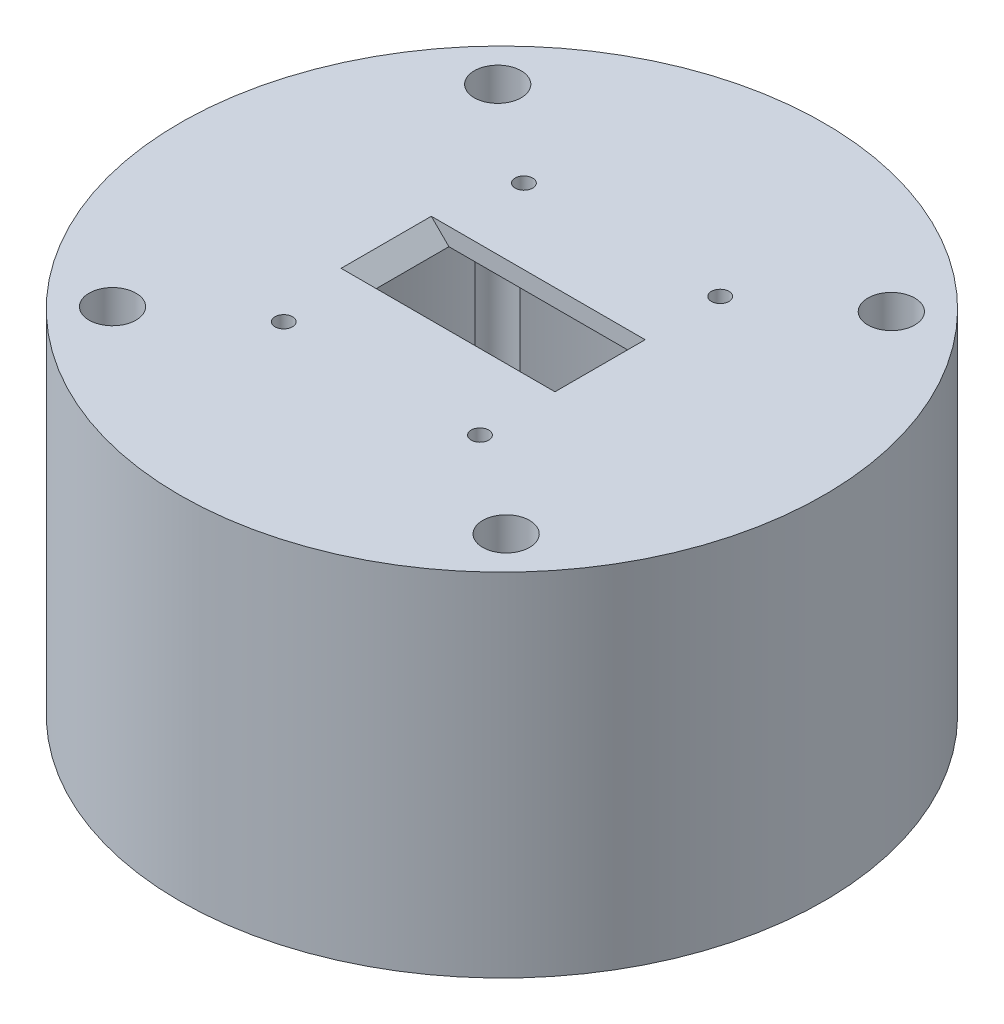
ISO-10303-21;
HEADER;
FILE_DESCRIPTION(('STEP AP214'),'2;1');
FILE_NAME('part.step','',(''),(''),'','','');
FILE_SCHEMA(('AUTOMOTIVE_DESIGN { 1 0 10303 214 1 1 1 1 }'));
ENDSEC;
DATA;
#1=APPLICATION_CONTEXT('core data for automotive mechanical design processes');
#2=APPLICATION_PROTOCOL_DEFINITION('international standard','automotive_design',2000,#1);
#3=PRODUCT_CONTEXT('',#1,'mechanical');
#4=PRODUCT('Part','Part','',(#3));
#5=PRODUCT_RELATED_PRODUCT_CATEGORY('part','',(#4));
#6=PRODUCT_DEFINITION_FORMATION('','',#4);
#7=PRODUCT_DEFINITION_CONTEXT('part definition',#1,'design');
#8=PRODUCT_DEFINITION('design','',#6,#7);
#9=PRODUCT_DEFINITION_SHAPE('','',#8);
#10=(LENGTH_UNIT() NAMED_UNIT(*) SI_UNIT(.MILLI.,.METRE.));
#11=(NAMED_UNIT(*) PLANE_ANGLE_UNIT() SI_UNIT($,.RADIAN.));
#12=(NAMED_UNIT(*) SI_UNIT($,.STERADIAN.) SOLID_ANGLE_UNIT());
#13=UNCERTAINTY_MEASURE_WITH_UNIT(LENGTH_MEASURE(1.E-05),#10,'distance_accuracy_value','');
#14=(GEOMETRIC_REPRESENTATION_CONTEXT(3) GLOBAL_UNCERTAINTY_ASSIGNED_CONTEXT((#13)) GLOBAL_UNIT_ASSIGNED_CONTEXT((#10,
#11,#12)) REPRESENTATION_CONTEXT('',''));
#15=CARTESIAN_POINT('',(0.,0.,0.));
#16=DIRECTION('',(0.,0.,1.));
#17=DIRECTION('',(1.,0.,0.));
#18=AXIS2_PLACEMENT_3D('',#15,#16,#17);
#19=CARTESIAN_POINT('',(16.75,60.,-7.7));
#20=DIRECTION('',(1.,0.,0.));
#21=DIRECTION('',(0.,0.,-1.));
#22=AXIS2_PLACEMENT_3D('',#19,#20,#21);
#23=PLANE('',#22);
#24=DIRECTION('',(0.,0.,-1.));
#25=VECTOR('',#24,1.);
#26=CARTESIAN_POINT('',(16.75,57.,-7.7));
#27=LINE('',#26,#25);
#28=CARTESIAN_POINT('',(16.75,57.,7.7));
#29=VERTEX_POINT('',#28);
#30=CARTESIAN_POINT('',(16.75,57.,-7.7));
#31=VERTEX_POINT('',#30);
#32=EDGE_CURVE('E263',#29,#31,#27,.T.);
#33=ORIENTED_EDGE('',*,*,#32,.F.);
#34=DIRECTION('',(0.,-1.,0.));
#35=VECTOR('',#34,1.);
#36=CARTESIAN_POINT('',(16.75,60.,7.7));
#37=LINE('',#36,#35);
#38=CARTESIAN_POINT('',(16.75,60.,7.7));
#39=VERTEX_POINT('',#38);
#40=EDGE_CURVE('E329',#39,#29,#37,.T.);
#41=ORIENTED_EDGE('',*,*,#40,.F.);
#42=DIRECTION('',(0.,0.,1.));
#43=VECTOR('',#42,1.);
#44=CARTESIAN_POINT('',(16.75,60.,-7.7));
#45=LINE('',#44,#43);
#46=CARTESIAN_POINT('',(16.75,60.,-7.7));
#47=VERTEX_POINT('',#46);
#48=EDGE_CURVE('E325',#47,#39,#45,.T.);
#49=ORIENTED_EDGE('',*,*,#48,.F.);
#50=DIRECTION('',(0.,-1.,0.));
#51=VECTOR('',#50,1.);
#52=CARTESIAN_POINT('',(16.75,60.,-7.7));
#53=LINE('',#52,#51);
#54=EDGE_CURVE('E330',#47,#31,#53,.T.);
#55=ORIENTED_EDGE('',*,*,#54,.T.);
#56=EDGE_LOOP('',(#33,#41,#49,#55));
#57=FACE_BOUND('',#56,.T.);
#58=ADVANCED_FACE('F33',(#57),#23,.F.);
#59=CARTESIAN_POINT('',(-16.75,60.,-7.7));
#60=DIRECTION('',(0.,0.,-1.));
#61=DIRECTION('',(-1.,0.,0.));
#62=AXIS2_PLACEMENT_3D('',#59,#60,#61);
#63=PLANE('',#62);
#64=DIRECTION('',(-1.,0.,0.));
#65=VECTOR('',#64,1.);
#66=CARTESIAN_POINT('',(-16.75,57.,-7.7));
#67=LINE('',#66,#65);
#68=CARTESIAN_POINT('',(-16.75,57.,-7.7));
#69=VERTEX_POINT('',#68);
#70=EDGE_CURVE('E260',#31,#69,#67,.T.);
#71=ORIENTED_EDGE('',*,*,#70,.F.);
#72=ORIENTED_EDGE('',*,*,#54,.F.);
#73=DIRECTION('',(1.,0.,0.));
#74=VECTOR('',#73,1.);
#75=CARTESIAN_POINT('',(-16.75,60.,-7.7));
#76=LINE('',#75,#74);
#77=CARTESIAN_POINT('',(-19.75,60.,-7.7));
#78=VERTEX_POINT('',#77);
#79=EDGE_CURVE('E48',#78,#47,#76,.T.);
#80=ORIENTED_EDGE('',*,*,#79,.F.);
#81=DIRECTION('',(0.707106781186546,-0.707106781186549,0.));
#82=VECTOR('',#81,1.);
#83=CARTESIAN_POINT('',(-18.25,58.5,-7.7));
#84=LINE('',#83,#82);
#85=EDGE_CURVE('E41',#78,#69,#84,.T.);
#86=ORIENTED_EDGE('',*,*,#85,.T.);
#87=EDGE_LOOP('',(#71,#72,#80,#86));
#88=FACE_BOUND('',#87,.T.);
#89=ADVANCED_FACE('F363',(#88),#63,.F.);
#90=CARTESIAN_POINT('',(-16.75,60.,7.7));
#91=DIRECTION('',(0.,0.,1.));
#92=DIRECTION('',(1.,0.,0.));
#93=AXIS2_PLACEMENT_3D('',#90,#91,#92);
#94=PLANE('',#93);
#95=DIRECTION('',(1.,0.,0.));
#96=VECTOR('',#95,1.);
#97=CARTESIAN_POINT('',(-16.75,57.,7.7));
#98=LINE('',#97,#96);
#99=CARTESIAN_POINT('',(-16.75,57.,7.7));
#100=VERTEX_POINT('',#99);
#101=EDGE_CURVE('E256',#100,#29,#98,.T.);
#102=ORIENTED_EDGE('',*,*,#101,.F.);
#103=DIRECTION('',(-0.707106781186546,0.707106781186549,0.));
#104=VECTOR('',#103,1.);
#105=CARTESIAN_POINT('',(-18.25,58.5,7.7));
#106=LINE('',#105,#104);
#107=CARTESIAN_POINT('',(-19.75,60.,7.7));
#108=VERTEX_POINT('',#107);
#109=EDGE_CURVE('E11',#100,#108,#106,.T.);
#110=ORIENTED_EDGE('',*,*,#109,.T.);
#111=DIRECTION('',(-1.,0.,0.));
#112=VECTOR('',#111,1.);
#113=CARTESIAN_POINT('',(-16.75,60.,7.7));
#114=LINE('',#113,#112);
#115=EDGE_CURVE('E56',#39,#108,#114,.T.);
#116=ORIENTED_EDGE('',*,*,#115,.F.);
#117=ORIENTED_EDGE('',*,*,#40,.T.);
#118=EDGE_LOOP('',(#102,#110,#116,#117));
#119=FACE_BOUND('',#118,.T.);
#120=ADVANCED_FACE('F371',(#119),#94,.F.);
#121=CARTESIAN_POINT('',(-16.75,0.,-20.5));
#122=DIRECTION('',(0.,1.,0.));
#123=DIRECTION('',(0.,0.,1.));
#124=AXIS2_PLACEMENT_3D('',#121,#122,#123);
#125=CYLINDRICAL_SURFACE('',#124,1.5);
#126=CARTESIAN_POINT('',(-16.75,60.,-20.5));
#127=DIRECTION('',(0.,1.,0.));
#128=DIRECTION('',(0.,0.,1.));
#129=AXIS2_PLACEMENT_3D('',#126,#127,#128);
#130=CIRCLE('',#129,1.5);
#131=CARTESIAN_POINT('',(-16.75,60.,-19.));
#132=VERTEX_POINT('',#131);
#133=EDGE_CURVE('E322',#132,#132,#130,.T.);
#134=ORIENTED_EDGE('',*,*,#133,.T.);
#135=EDGE_LOOP('',(#134));
#136=FACE_BOUND('',#135,.T.);
#137=CARTESIAN_POINT('',(-16.75,57.,-20.5));
#138=DIRECTION('',(0.,-1.,0.));
#139=DIRECTION('',(0.,0.,-1.));
#140=AXIS2_PLACEMENT_3D('',#137,#138,#139);
#141=CIRCLE('',#140,1.5);
#142=CARTESIAN_POINT('',(-16.75,57.,-22.));
#143=VERTEX_POINT('',#142);
#144=EDGE_CURVE('E253',#143,#143,#141,.F.);
#145=ORIENTED_EDGE('',*,*,#144,.F.);
#146=EDGE_LOOP('',(#145));
#147=FACE_BOUND('',#146,.T.);
#148=ADVANCED_FACE('F460',(#136,#147),#125,.F.);
#149=CARTESIAN_POINT('',(16.75,0.,-20.5));
#150=DIRECTION('',(0.,1.,0.));
#151=DIRECTION('',(0.,0.,1.));
#152=AXIS2_PLACEMENT_3D('',#149,#150,#151);
#153=CYLINDRICAL_SURFACE('',#152,1.5);
#154=CARTESIAN_POINT('',(16.75,60.,-20.5));
#155=DIRECTION('',(0.,1.,0.));
#156=DIRECTION('',(0.,0.,1.));
#157=AXIS2_PLACEMENT_3D('',#154,#155,#156);
#158=CIRCLE('',#157,1.5);
#159=CARTESIAN_POINT('',(16.75,60.,-19.));
#160=VERTEX_POINT('',#159);
#161=EDGE_CURVE('E290',#160,#160,#158,.T.);
#162=ORIENTED_EDGE('',*,*,#161,.T.);
#163=EDGE_LOOP('',(#162));
#164=FACE_BOUND('',#163,.T.);
#165=CARTESIAN_POINT('',(16.75,57.,-20.5));
#166=DIRECTION('',(0.,-1.,0.));
#167=DIRECTION('',(0.,0.,-1.));
#168=AXIS2_PLACEMENT_3D('',#165,#166,#167);
#169=CIRCLE('',#168,1.5);
#170=CARTESIAN_POINT('',(16.75,57.,-22.));
#171=VERTEX_POINT('',#170);
#172=EDGE_CURVE('E250',#171,#171,#169,.F.);
#173=ORIENTED_EDGE('',*,*,#172,.F.);
#174=EDGE_LOOP('',(#173));
#175=FACE_BOUND('',#174,.T.);
#176=ADVANCED_FACE('F456',(#164,#175),#153,.F.);
#177=CARTESIAN_POINT('',(-16.75,0.,20.5));
#178=DIRECTION('',(0.,1.,0.));
#179=DIRECTION('',(0.,0.,1.));
#180=AXIS2_PLACEMENT_3D('',#177,#178,#179);
#181=CYLINDRICAL_SURFACE('',#180,1.5);
#182=CARTESIAN_POINT('',(-16.75,60.,20.5));
#183=DIRECTION('',(0.,1.,0.));
#184=DIRECTION('',(0.,0.,1.));
#185=AXIS2_PLACEMENT_3D('',#182,#183,#184);
#186=CIRCLE('',#185,1.5);
#187=CARTESIAN_POINT('',(-16.75,60.,22.));
#188=VERTEX_POINT('',#187);
#189=EDGE_CURVE('E294',#188,#188,#186,.T.);
#190=ORIENTED_EDGE('',*,*,#189,.T.);
#191=EDGE_LOOP('',(#190));
#192=FACE_BOUND('',#191,.T.);
#193=CARTESIAN_POINT('',(-16.75,57.,20.5));
#194=DIRECTION('',(0.,-1.,0.));
#195=DIRECTION('',(0.,0.,-1.));
#196=AXIS2_PLACEMENT_3D('',#193,#194,#195);
#197=CIRCLE('',#196,1.5);
#198=CARTESIAN_POINT('',(-16.75,57.,19.));
#199=VERTEX_POINT('',#198);
#200=EDGE_CURVE('E247',#199,#199,#197,.F.);
#201=ORIENTED_EDGE('',*,*,#200,.F.);
#202=EDGE_LOOP('',(#201));
#203=FACE_BOUND('',#202,.T.);
#204=ADVANCED_FACE('F459',(#192,#203),#181,.F.);
#205=CARTESIAN_POINT('',(16.75,0.,20.5));
#206=DIRECTION('',(0.,1.,0.));
#207=DIRECTION('',(0.,0.,1.));
#208=AXIS2_PLACEMENT_3D('',#205,#206,#207);
#209=CYLINDRICAL_SURFACE('',#208,1.5);
#210=CARTESIAN_POINT('',(16.75,60.,20.5));
#211=DIRECTION('',(0.,1.,0.));
#212=DIRECTION('',(0.,0.,1.));
#213=AXIS2_PLACEMENT_3D('',#210,#211,#212);
#214=CIRCLE('',#213,1.5);
#215=CARTESIAN_POINT('',(16.75,60.,22.));
#216=VERTEX_POINT('',#215);
#217=EDGE_CURVE('E269',#216,#216,#214,.T.);
#218=ORIENTED_EDGE('',*,*,#217,.T.);
#219=EDGE_LOOP('',(#218));
#220=FACE_BOUND('',#219,.T.);
#221=CARTESIAN_POINT('',(16.75,57.,20.5));
#222=DIRECTION('',(0.,-1.,0.));
#223=DIRECTION('',(0.,0.,-1.));
#224=AXIS2_PLACEMENT_3D('',#221,#222,#223);
#225=CIRCLE('',#224,1.5);
#226=CARTESIAN_POINT('',(16.75,57.,19.));
#227=VERTEX_POINT('',#226);
#228=EDGE_CURVE('E235',#227,#227,#225,.F.);
#229=ORIENTED_EDGE('',*,*,#228,.F.);
#230=EDGE_LOOP('',(#229));
#231=FACE_BOUND('',#230,.T.);
#232=ADVANCED_FACE('F464',(#220,#231),#209,.F.);
#233=CARTESIAN_POINT('',(0.,50.,0.));
#234=DIRECTION('',(0.,-1.,0.));
#235=DIRECTION('',(0.,0.,-1.));
#236=AXIS2_PLACEMENT_3D('',#233,#234,#235);
#237=CYLINDRICAL_SURFACE('',#236,50.);
#238=CARTESIAN_POINT('',(0.,50.,0.));
#239=DIRECTION('',(0.,-1.,0.));
#240=DIRECTION('',(0.,0.,-1.));
#241=AXIS2_PLACEMENT_3D('',#238,#239,#240);
#242=CIRCLE('',#241,50.);
#243=CARTESIAN_POINT('',(37.590562846943,50.,-32.9689184664895));
#244=VERTEX_POINT('',#243);
#245=CARTESIAN_POINT('',(37.590562846943,50.,32.9689184664894));
#246=VERTEX_POINT('',#245);
#247=EDGE_CURVE('E341',#244,#246,#242,.T.);
#248=ORIENTED_EDGE('',*,*,#247,.F.);
#249=DIRECTION('',(0.,1.,0.));
#250=VECTOR('',#249,1.);
#251=CARTESIAN_POINT('',(37.5905628469429,30.,-32.9689184664895));
#252=LINE('',#251,#250);
#253=CARTESIAN_POINT('',(37.5905628469429,0.,-32.9689184664896));
#254=VERTEX_POINT('',#253);
#255=EDGE_CURVE('E319',#244,#254,#252,.F.);
#256=ORIENTED_EDGE('',*,*,#255,.T.);
#257=CARTESIAN_POINT('',(0.,0.,0.));
#258=DIRECTION('',(0.,-1.,0.));
#259=DIRECTION('',(0.,0.,-1.));
#260=AXIS2_PLACEMENT_3D('',#257,#258,#259);
#261=CIRCLE('',#260,50.);
#262=CARTESIAN_POINT('',(37.5905628469429,0.,32.9689184664895));
#263=VERTEX_POINT('',#262);
#264=EDGE_CURVE('E340',#254,#263,#261,.T.);
#265=ORIENTED_EDGE('',*,*,#264,.T.);
#266=DIRECTION('',(0.,1.,0.));
#267=VECTOR('',#266,1.);
#268=CARTESIAN_POINT('',(37.5905628469429,30.,32.9689184664894));
#269=LINE('',#268,#267);
#270=EDGE_CURVE('E293',#263,#246,#269,.T.);
#271=ORIENTED_EDGE('',*,*,#270,.T.);
#272=EDGE_LOOP('',(#248,#256,#265,#271));
#273=FACE_BOUND('',#272,.T.);
#274=ADVANCED_FACE('F398',(#273),#237,.F.);
#275=CARTESIAN_POINT('',(-33.7747495446768,0.,-36.868228777558));
#276=VERTEX_POINT('',#275);
#277=CARTESIAN_POINT('',(33.7747495446768,0.,-36.868228777558));
#278=VERTEX_POINT('',#277);
#279=EDGE_CURVE('E333',#276,#278,#261,.T.);
#280=ORIENTED_EDGE('',*,*,#279,.T.);
#281=DIRECTION('',(0.,1.,0.));
#282=VECTOR('',#281,1.);
#283=CARTESIAN_POINT('',(33.7747495446767,30.,-36.868228777558));
#284=LINE('',#283,#282);
#285=CARTESIAN_POINT('',(33.7747495446767,50.,-36.8682287775581));
#286=VERTEX_POINT('',#285);
#287=EDGE_CURVE('E316',#278,#286,#284,.T.);
#288=ORIENTED_EDGE('',*,*,#287,.T.);
#289=CARTESIAN_POINT('',(-33.7747495446767,50.,-36.8682287775581));
#290=VERTEX_POINT('',#289);
#291=EDGE_CURVE('E336',#290,#286,#242,.T.);
#292=ORIENTED_EDGE('',*,*,#291,.F.);
#293=DIRECTION('',(0.,1.,0.));
#294=VECTOR('',#293,1.);
#295=CARTESIAN_POINT('',(-33.7747495446767,30.,-36.868228777558));
#296=LINE('',#295,#294);
#297=EDGE_CURVE('E313',#290,#276,#296,.F.);
#298=ORIENTED_EDGE('',*,*,#297,.T.);
#299=EDGE_LOOP('',(#280,#288,#292,#298));
#300=FACE_BOUND('',#299,.T.);
#301=ADVANCED_FACE('F441',(#300),#237,.F.);
#302=CARTESIAN_POINT('',(-37.5905628469429,0.,32.9689184664895));
#303=VERTEX_POINT('',#302);
#304=CARTESIAN_POINT('',(-37.5905628469429,0.,-32.9689184664895));
#305=VERTEX_POINT('',#304);
#306=EDGE_CURVE('E344',#303,#305,#261,.T.);
#307=ORIENTED_EDGE('',*,*,#306,.T.);
#308=DIRECTION('',(0.,1.,0.));
#309=VECTOR('',#308,1.);
#310=CARTESIAN_POINT('',(-37.5905628469429,30.,-32.9689184664894));
#311=LINE('',#310,#309);
#312=CARTESIAN_POINT('',(-37.590562846943,50.,-32.9689184664894));
#313=VERTEX_POINT('',#312);
#314=EDGE_CURVE('E310',#305,#313,#311,.T.);
#315=ORIENTED_EDGE('',*,*,#314,.T.);
#316=CARTESIAN_POINT('',(-37.590562846943,50.,32.9689184664894));
#317=VERTEX_POINT('',#316);
#318=EDGE_CURVE('E339',#317,#313,#242,.T.);
#319=ORIENTED_EDGE('',*,*,#318,.F.);
#320=DIRECTION('',(0.,1.,0.));
#321=VECTOR('',#320,1.);
#322=CARTESIAN_POINT('',(-37.5905628469429,30.,32.9689184664894));
#323=LINE('',#322,#321);
#324=EDGE_CURVE('E307',#317,#303,#323,.F.);
#325=ORIENTED_EDGE('',*,*,#324,.T.);
#326=EDGE_LOOP('',(#307,#315,#319,#325));
#327=FACE_BOUND('',#326,.T.);
#328=ADVANCED_FACE('F385',(#327),#237,.F.);
#329=CARTESIAN_POINT('',(0.,60.,0.));
#330=DIRECTION('',(0.,-1.,0.));
#331=DIRECTION('',(0.,0.,-1.));
#332=AXIS2_PLACEMENT_3D('',#329,#330,#331);
#333=CYLINDRICAL_SURFACE('',#332,55.);
#334=CARTESIAN_POINT('',(0.,60.,0.));
#335=DIRECTION('',(0.,1.,0.));
#336=DIRECTION('',(0.,0.,1.));
#337=AXIS2_PLACEMENT_3D('',#334,#335,#336);
#338=CIRCLE('',#337,55.);
#339=CARTESIAN_POINT('',(0.,60.,55.));
#340=VERTEX_POINT('',#339);
#341=EDGE_CURVE('E345',#340,#340,#338,.T.);
#342=ORIENTED_EDGE('',*,*,#341,.F.);
#343=EDGE_LOOP('',(#342));
#344=FACE_BOUND('',#343,.T.);
#345=CARTESIAN_POINT('',(0.,0.,0.));
#346=DIRECTION('',(0.,1.,0.));
#347=DIRECTION('',(0.,0.,1.));
#348=AXIS2_PLACEMENT_3D('',#345,#346,#347);
#349=CIRCLE('',#348,55.);
#350=CARTESIAN_POINT('',(0.,0.,55.));
#351=VERTEX_POINT('',#350);
#352=EDGE_CURVE('E349',#351,#351,#349,.T.);
#353=ORIENTED_EDGE('',*,*,#352,.T.);
#354=EDGE_LOOP('',(#353));
#355=FACE_BOUND('',#354,.T.);
#356=ADVANCED_FACE('F378',(#344,#355),#333,.T.);
#357=CARTESIAN_POINT('',(0.,60.,0.));
#358=DIRECTION('',(0.,1.,0.));
#359=DIRECTION('',(0.,0.,1.));
#360=AXIS2_PLACEMENT_3D('',#357,#358,#359);
#361=PLANE('',#360);
#362=CARTESIAN_POINT('',(33.5917270558466,60.,-32.8724181253145));
#363=DIRECTION('',(0.,1.,0.));
#364=DIRECTION('',(0.,0.,1.));
#365=AXIS2_PLACEMENT_3D('',#362,#363,#364);
#366=CIRCLE('',#365,4.);
#367=CARTESIAN_POINT('',(33.5917270558466,60.,-28.8724181253145));
#368=VERTEX_POINT('',#367);
#369=EDGE_CURVE('E265',#368,#368,#366,.T.);
#370=ORIENTED_EDGE('',*,*,#369,.F.);
#371=EDGE_LOOP('',(#370));
#372=FACE_BOUND('',#371,.T.);
#373=CARTESIAN_POINT('',(-33.5917270558466,60.,-32.8724181253145));
#374=DIRECTION('',(0.,1.,0.));
#375=DIRECTION('',(0.,0.,1.));
#376=AXIS2_PLACEMENT_3D('',#373,#374,#375);
#377=CIRCLE('',#376,4.);
#378=CARTESIAN_POINT('',(-33.5917270558466,60.,-28.8724181253145));
#379=VERTEX_POINT('',#378);
#380=EDGE_CURVE('E282',#379,#379,#377,.T.);
#381=ORIENTED_EDGE('',*,*,#380,.F.);
#382=EDGE_LOOP('',(#381));
#383=FACE_BOUND('',#382,.T.);
#384=CARTESIAN_POINT('',(-33.5917270558466,60.,32.8724181253145));
#385=DIRECTION('',(0.,1.,0.));
#386=DIRECTION('',(0.,0.,1.));
#387=AXIS2_PLACEMENT_3D('',#384,#385,#386);
#388=CIRCLE('',#387,4.);
#389=CARTESIAN_POINT('',(-33.5917270558466,60.,36.8724181253145));
#390=VERTEX_POINT('',#389);
#391=EDGE_CURVE('E276',#390,#390,#388,.T.);
#392=ORIENTED_EDGE('',*,*,#391,.F.);
#393=EDGE_LOOP('',(#392));
#394=FACE_BOUND('',#393,.T.);
#395=CARTESIAN_POINT('',(33.5917270558466,60.,32.8724181253145));
#396=DIRECTION('',(0.,1.,0.));
#397=DIRECTION('',(0.,0.,1.));
#398=AXIS2_PLACEMENT_3D('',#395,#396,#397);
#399=CIRCLE('',#398,4.00000000000001);
#400=CARTESIAN_POINT('',(33.5917270558466,60.,36.8724181253145));
#401=VERTEX_POINT('',#400);
#402=EDGE_CURVE('E270',#401,#401,#399,.T.);
#403=ORIENTED_EDGE('',*,*,#402,.F.);
#404=EDGE_LOOP('',(#403));
#405=FACE_BOUND('',#404,.T.);
#406=ORIENTED_EDGE('',*,*,#217,.F.);
#407=EDGE_LOOP('',(#406));
#408=FACE_BOUND('',#407,.T.);
#409=ORIENTED_EDGE('',*,*,#189,.F.);
#410=EDGE_LOOP('',(#409));
#411=FACE_BOUND('',#410,.T.);
#412=ORIENTED_EDGE('',*,*,#161,.F.);
#413=EDGE_LOOP('',(#412));
#414=FACE_BOUND('',#413,.T.);
#415=ORIENTED_EDGE('',*,*,#133,.F.);
#416=EDGE_LOOP('',(#415));
#417=FACE_BOUND('',#416,.T.);
#418=DIRECTION('',(0.,0.,-1.));
#419=VECTOR('',#418,1.);
#420=CARTESIAN_POINT('',(-19.75,60.,-7.7));
#421=LINE('',#420,#419);
#422=EDGE_CURVE('E359',#108,#78,#421,.T.);
#423=ORIENTED_EDGE('',*,*,#422,.T.);
#424=ORIENTED_EDGE('',*,*,#79,.T.);
#425=ORIENTED_EDGE('',*,*,#48,.T.);
#426=ORIENTED_EDGE('',*,*,#115,.T.);
#427=EDGE_LOOP('',(#423,#424,#425,#426));
#428=FACE_BOUND('',#427,.T.);
#429=ORIENTED_EDGE('',*,*,#341,.T.);
#430=EDGE_LOOP('',(#429));
#431=FACE_BOUND('',#430,.T.);
#432=ADVANCED_FACE('F374',(#372,#383,#394,#405,#408,#411,#414,#417,#428,#431),#361,.T.);
#433=CARTESIAN_POINT('',(0.,0.,0.));
#434=DIRECTION('',(0.,1.,0.));
#435=DIRECTION('',(0.,0.,1.));
#436=AXIS2_PLACEMENT_3D('',#433,#434,#435);
#437=PLANE('',#436);
#438=ORIENTED_EDGE('',*,*,#264,.F.);
#439=CARTESIAN_POINT('',(33.5917270558466,0.,-32.8724181253145));
#440=DIRECTION('',(0.,1.,0.));
#441=DIRECTION('',(0.,0.,1.));
#442=AXIS2_PLACEMENT_3D('',#439,#440,#441);
#443=CIRCLE('',#442,4.);
#444=EDGE_CURVE('E285',#254,#278,#443,.T.);
#445=ORIENTED_EDGE('',*,*,#444,.T.);
#446=ORIENTED_EDGE('',*,*,#279,.F.);
#447=CARTESIAN_POINT('',(-33.5917270558466,0.,-32.8724181253145));
#448=DIRECTION('',(0.,1.,0.));
#449=DIRECTION('',(0.,0.,1.));
#450=AXIS2_PLACEMENT_3D('',#447,#448,#449);
#451=CIRCLE('',#450,4.);
#452=EDGE_CURVE('E279',#276,#305,#451,.T.);
#453=ORIENTED_EDGE('',*,*,#452,.T.);
#454=ORIENTED_EDGE('',*,*,#306,.F.);
#455=CARTESIAN_POINT('',(-33.5917270558466,0.,32.8724181253145));
#456=DIRECTION('',(0.,1.,0.));
#457=DIRECTION('',(0.,0.,1.));
#458=AXIS2_PLACEMENT_3D('',#455,#456,#457);
#459=CIRCLE('',#458,4.);
#460=CARTESIAN_POINT('',(-33.7747495446768,0.,36.868228777558));
#461=VERTEX_POINT('',#460);
#462=EDGE_CURVE('E273',#303,#461,#459,.T.);
#463=ORIENTED_EDGE('',*,*,#462,.T.);
#464=CARTESIAN_POINT('',(33.7747495446768,0.,36.868228777558));
#465=VERTEX_POINT('',#464);
#466=EDGE_CURVE('E687',#465,#461,#261,.T.);
#467=ORIENTED_EDGE('',*,*,#466,.F.);
#468=CARTESIAN_POINT('',(33.5917270558466,0.,32.8724181253145));
#469=DIRECTION('',(0.,1.,0.));
#470=DIRECTION('',(0.,0.,1.));
#471=AXIS2_PLACEMENT_3D('',#468,#469,#470);
#472=CIRCLE('',#471,4.00000000000001);
#473=EDGE_CURVE('E266',#465,#263,#472,.T.);
#474=ORIENTED_EDGE('',*,*,#473,.T.);
#475=EDGE_LOOP('',(#438,#445,#446,#453,#454,#463,#467,#474));
#476=FACE_BOUND('',#475,.T.);
#477=ORIENTED_EDGE('',*,*,#352,.F.);
#478=EDGE_LOOP('',(#477));
#479=FACE_BOUND('',#478,.T.);
#480=ADVANCED_FACE('F377',(#476,#479),#437,.F.);
#481=ORIENTED_EDGE('',*,*,#466,.T.);
#482=DIRECTION('',(0.,1.,0.));
#483=VECTOR('',#482,1.);
#484=CARTESIAN_POINT('',(-33.7747495446767,30.,36.868228777558));
#485=LINE('',#484,#483);
#486=CARTESIAN_POINT('',(-33.7747495446767,50.,36.8682287775581));
#487=VERTEX_POINT('',#486);
#488=EDGE_CURVE('E304',#461,#487,#485,.T.);
#489=ORIENTED_EDGE('',*,*,#488,.T.);
#490=CARTESIAN_POINT('',(33.7747495446767,50.,36.8682287775581));
#491=VERTEX_POINT('',#490);
#492=EDGE_CURVE('E428',#491,#487,#242,.T.);
#493=ORIENTED_EDGE('',*,*,#492,.F.);
#494=DIRECTION('',(0.,1.,0.));
#495=VECTOR('',#494,1.);
#496=CARTESIAN_POINT('',(33.7747495446767,30.,36.868228777558));
#497=LINE('',#496,#495);
#498=EDGE_CURVE('E301',#491,#465,#497,.F.);
#499=ORIENTED_EDGE('',*,*,#498,.T.);
#500=EDGE_LOOP('',(#481,#489,#493,#499));
#501=FACE_BOUND('',#500,.T.);
#502=ADVANCED_FACE('F389',(#501),#237,.F.);
#503=CARTESIAN_POINT('',(0.,50.,0.));
#504=DIRECTION('',(0.,-1.,0.));
#505=DIRECTION('',(0.,0.,-1.));
#506=AXIS2_PLACEMENT_3D('',#503,#504,#505);
#507=PLANE('',#506);
#508=CARTESIAN_POINT('',(22.5,50.,22.5));
#509=DIRECTION('',(0.,-1.,0.));
#510=DIRECTION('',(0.,0.,-1.));
#511=AXIS2_PLACEMENT_3D('',#508,#509,#510);
#512=CIRCLE('',#511,10.);
#513=CARTESIAN_POINT('',(32.5,50.,22.5));
#514=VERTEX_POINT('',#513);
#515=CARTESIAN_POINT('',(22.5,50.,32.5));
#516=VERTEX_POINT('',#515);
#517=EDGE_CURVE('E178',#514,#516,#512,.T.);
#518=ORIENTED_EDGE('',*,*,#517,.F.);
#519=DIRECTION('',(0.,0.,1.));
#520=VECTOR('',#519,1.);
#521=CARTESIAN_POINT('',(32.5,50.,-22.5));
#522=LINE('',#521,#520);
#523=CARTESIAN_POINT('',(32.5,50.,-22.5));
#524=VERTEX_POINT('',#523);
#525=EDGE_CURVE('E197',#524,#514,#522,.T.);
#526=ORIENTED_EDGE('',*,*,#525,.F.);
#527=CARTESIAN_POINT('',(22.5,50.,-22.5));
#528=DIRECTION('',(0.,-1.,0.));
#529=DIRECTION('',(0.,0.,1.));
#530=AXIS2_PLACEMENT_3D('',#527,#528,#529);
#531=CIRCLE('',#530,10.);
#532=CARTESIAN_POINT('',(22.5,50.,-32.5));
#533=VERTEX_POINT('',#532);
#534=EDGE_CURVE('E200',#533,#524,#531,.T.);
#535=ORIENTED_EDGE('',*,*,#534,.F.);
#536=DIRECTION('',(1.,0.,0.));
#537=VECTOR('',#536,1.);
#538=CARTESIAN_POINT('',(-22.5,50.,-32.5));
#539=LINE('',#538,#537);
#540=CARTESIAN_POINT('',(-22.5,50.,-32.5));
#541=VERTEX_POINT('',#540);
#542=EDGE_CURVE('E228',#541,#533,#539,.T.);
#543=ORIENTED_EDGE('',*,*,#542,.F.);
#544=CARTESIAN_POINT('',(-22.5,50.,-22.5));
#545=DIRECTION('',(0.,-1.,0.));
#546=DIRECTION('',(0.,0.,-1.));
#547=AXIS2_PLACEMENT_3D('',#544,#545,#546);
#548=CIRCLE('',#547,10.);
#549=CARTESIAN_POINT('',(-32.5,50.,-22.5));
#550=VERTEX_POINT('',#549);
#551=EDGE_CURVE('E225',#550,#541,#548,.T.);
#552=ORIENTED_EDGE('',*,*,#551,.F.);
#553=DIRECTION('',(0.,0.,-1.));
#554=VECTOR('',#553,1.);
#555=CARTESIAN_POINT('',(-32.5,50.,-22.5));
#556=LINE('',#555,#554);
#557=CARTESIAN_POINT('',(-32.5,50.,22.5));
#558=VERTEX_POINT('',#557);
#559=EDGE_CURVE('E222',#558,#550,#556,.T.);
#560=ORIENTED_EDGE('',*,*,#559,.F.);
#561=CARTESIAN_POINT('',(-22.5,50.,22.5));
#562=DIRECTION('',(0.,-1.,0.));
#563=DIRECTION('',(0.,0.,1.));
#564=AXIS2_PLACEMENT_3D('',#561,#562,#563);
#565=CIRCLE('',#564,10.);
#566=CARTESIAN_POINT('',(-22.5,50.,32.5));
#567=VERTEX_POINT('',#566);
#568=EDGE_CURVE('E219',#567,#558,#565,.T.);
#569=ORIENTED_EDGE('',*,*,#568,.F.);
#570=DIRECTION('',(-1.,0.,0.));
#571=VECTOR('',#570,1.);
#572=CARTESIAN_POINT('',(-22.5,50.,32.5));
#573=LINE('',#572,#571);
#574=EDGE_CURVE('E217',#516,#567,#573,.T.);
#575=ORIENTED_EDGE('',*,*,#574,.F.);
#576=EDGE_LOOP('',(#518,#526,#535,#543,#552,#560,#569,#575));
#577=FACE_BOUND('',#576,.T.);
#578=CARTESIAN_POINT('',(33.5917270558466,50.,-32.8724181253145));
#579=DIRECTION('',(0.,-1.,0.));
#580=DIRECTION('',(0.,0.,-1.));
#581=AXIS2_PLACEMENT_3D('',#578,#579,#580);
#582=CIRCLE('',#581,4.);
#583=EDGE_CURVE('E357',#244,#286,#582,.T.);
#584=ORIENTED_EDGE('',*,*,#583,.F.);
#585=ORIENTED_EDGE('',*,*,#247,.T.);
#586=CARTESIAN_POINT('',(33.5917270558466,50.,32.8724181253145));
#587=DIRECTION('',(0.,-1.,0.));
#588=DIRECTION('',(0.,0.,-1.));
#589=AXIS2_PLACEMENT_3D('',#586,#587,#588);
#590=CIRCLE('',#589,4.00000000000001);
#591=EDGE_CURVE('E348',#491,#246,#590,.T.);
#592=ORIENTED_EDGE('',*,*,#591,.F.);
#593=ORIENTED_EDGE('',*,*,#492,.T.);
#594=CARTESIAN_POINT('',(-33.5917270558466,50.,32.8724181253145));
#595=DIRECTION('',(0.,-1.,0.));
#596=DIRECTION('',(0.,0.,-1.));
#597=AXIS2_PLACEMENT_3D('',#594,#595,#596);
#598=CIRCLE('',#597,4.);
#599=EDGE_CURVE('E353',#317,#487,#598,.T.);
#600=ORIENTED_EDGE('',*,*,#599,.F.);
#601=ORIENTED_EDGE('',*,*,#318,.T.);
#602=CARTESIAN_POINT('',(-33.5917270558466,50.,-32.8724181253145));
#603=DIRECTION('',(0.,-1.,0.));
#604=DIRECTION('',(0.,0.,-1.));
#605=AXIS2_PLACEMENT_3D('',#602,#603,#604);
#606=CIRCLE('',#605,4.);
#607=EDGE_CURVE('E355',#290,#313,#606,.T.);
#608=ORIENTED_EDGE('',*,*,#607,.F.);
#609=ORIENTED_EDGE('',*,*,#291,.T.);
#610=EDGE_LOOP('',(#584,#585,#592,#593,#600,#601,#608,#609));
#611=FACE_BOUND('',#610,.T.);
#612=ADVANCED_FACE('F395',(#577,#611),#507,.T.);
#613=CARTESIAN_POINT('',(33.5917270558466,0.,32.8724181253145));
#614=DIRECTION('',(0.,1.,0.));
#615=DIRECTION('',(0.,0.,1.));
#616=AXIS2_PLACEMENT_3D('',#613,#614,#615);
#617=CYLINDRICAL_SURFACE('',#616,4.00000000000001);
#618=ORIENTED_EDGE('',*,*,#402,.T.);
#619=EDGE_LOOP('',(#618));
#620=FACE_BOUND('',#619,.T.);
#621=ORIENTED_EDGE('',*,*,#591,.T.);
#622=ORIENTED_EDGE('',*,*,#270,.F.);
#623=ORIENTED_EDGE('',*,*,#473,.F.);
#624=ORIENTED_EDGE('',*,*,#498,.F.);
#625=EDGE_LOOP('',(#621,#622,#623,#624));
#626=FACE_BOUND('',#625,.T.);
#627=ADVANCED_FACE('F409',(#620,#626),#617,.F.);
#628=CARTESIAN_POINT('',(-33.5917270558466,0.,32.8724181253145));
#629=DIRECTION('',(0.,1.,0.));
#630=DIRECTION('',(0.,0.,1.));
#631=AXIS2_PLACEMENT_3D('',#628,#629,#630);
#632=CYLINDRICAL_SURFACE('',#631,4.);
#633=ORIENTED_EDGE('',*,*,#391,.T.);
#634=EDGE_LOOP('',(#633));
#635=FACE_BOUND('',#634,.T.);
#636=ORIENTED_EDGE('',*,*,#599,.T.);
#637=ORIENTED_EDGE('',*,*,#488,.F.);
#638=ORIENTED_EDGE('',*,*,#462,.F.);
#639=ORIENTED_EDGE('',*,*,#324,.F.);
#640=EDGE_LOOP('',(#636,#637,#638,#639));
#641=FACE_BOUND('',#640,.T.);
#642=ADVANCED_FACE('F414',(#635,#641),#632,.F.);
#643=CARTESIAN_POINT('',(-33.5917270558466,0.,-32.8724181253145));
#644=DIRECTION('',(0.,1.,0.));
#645=DIRECTION('',(0.,0.,1.));
#646=AXIS2_PLACEMENT_3D('',#643,#644,#645);
#647=CYLINDRICAL_SURFACE('',#646,4.);
#648=ORIENTED_EDGE('',*,*,#380,.T.);
#649=EDGE_LOOP('',(#648));
#650=FACE_BOUND('',#649,.T.);
#651=ORIENTED_EDGE('',*,*,#607,.T.);
#652=ORIENTED_EDGE('',*,*,#314,.F.);
#653=ORIENTED_EDGE('',*,*,#452,.F.);
#654=ORIENTED_EDGE('',*,*,#297,.F.);
#655=EDGE_LOOP('',(#651,#652,#653,#654));
#656=FACE_BOUND('',#655,.T.);
#657=ADVANCED_FACE('F438',(#650,#656),#647,.F.);
#658=CARTESIAN_POINT('',(33.5917270558466,0.,-32.8724181253145));
#659=DIRECTION('',(0.,1.,0.));
#660=DIRECTION('',(0.,0.,1.));
#661=AXIS2_PLACEMENT_3D('',#658,#659,#660);
#662=CYLINDRICAL_SURFACE('',#661,4.);
#663=ORIENTED_EDGE('',*,*,#369,.T.);
#664=EDGE_LOOP('',(#663));
#665=FACE_BOUND('',#664,.T.);
#666=ORIENTED_EDGE('',*,*,#583,.T.);
#667=ORIENTED_EDGE('',*,*,#287,.F.);
#668=ORIENTED_EDGE('',*,*,#444,.F.);
#669=ORIENTED_EDGE('',*,*,#255,.F.);
#670=EDGE_LOOP('',(#666,#667,#668,#669));
#671=FACE_BOUND('',#670,.T.);
#672=ADVANCED_FACE('F442',(#665,#671),#662,.F.);
#673=CARTESIAN_POINT('',(22.5,57.,22.5));
#674=DIRECTION('',(0.,-1.,0.));
#675=DIRECTION('',(0.,0.,-1.));
#676=AXIS2_PLACEMENT_3D('',#673,#674,#675);
#677=PLANE('',#676);
#678=ORIENTED_EDGE('',*,*,#144,.T.);
#679=EDGE_LOOP('',(#678));
#680=FACE_BOUND('',#679,.T.);
#681=ORIENTED_EDGE('',*,*,#172,.T.);
#682=EDGE_LOOP('',(#681));
#683=FACE_BOUND('',#682,.T.);
#684=ORIENTED_EDGE('',*,*,#200,.T.);
#685=EDGE_LOOP('',(#684));
#686=FACE_BOUND('',#685,.T.);
#687=ORIENTED_EDGE('',*,*,#228,.T.);
#688=EDGE_LOOP('',(#687));
#689=FACE_BOUND('',#688,.T.);
#690=CARTESIAN_POINT('',(22.5,57.,22.5));
#691=DIRECTION('',(0.,-1.,0.));
#692=DIRECTION('',(0.,0.,-1.));
#693=AXIS2_PLACEMENT_3D('',#690,#691,#692);
#694=CIRCLE('',#693,10.);
#695=CARTESIAN_POINT('',(32.5,57.,22.5));
#696=VERTEX_POINT('',#695);
#697=CARTESIAN_POINT('',(22.5,57.,32.5));
#698=VERTEX_POINT('',#697);
#699=EDGE_CURVE('E175',#696,#698,#694,.T.);
#700=ORIENTED_EDGE('',*,*,#699,.T.);
#701=DIRECTION('',(-1.,0.,0.));
#702=VECTOR('',#701,1.);
#703=CARTESIAN_POINT('',(-22.5,57.,32.5));
#704=LINE('',#703,#702);
#705=CARTESIAN_POINT('',(-22.5,57.,32.5));
#706=VERTEX_POINT('',#705);
#707=EDGE_CURVE('E186',#698,#706,#704,.T.);
#708=ORIENTED_EDGE('',*,*,#707,.T.);
#709=CARTESIAN_POINT('',(-22.5,57.,22.5));
#710=DIRECTION('',(0.,-1.,0.));
#711=DIRECTION('',(0.,0.,1.));
#712=AXIS2_PLACEMENT_3D('',#709,#710,#711);
#713=CIRCLE('',#712,10.);
#714=CARTESIAN_POINT('',(-32.5,57.,22.5));
#715=VERTEX_POINT('',#714);
#716=EDGE_CURVE('E191',#706,#715,#713,.T.);
#717=ORIENTED_EDGE('',*,*,#716,.T.);
#718=DIRECTION('',(0.,0.,-1.));
#719=VECTOR('',#718,1.);
#720=CARTESIAN_POINT('',(-32.5,57.,-22.5));
#721=LINE('',#720,#719);
#722=CARTESIAN_POINT('',(-32.5,57.,-22.5));
#723=VERTEX_POINT('',#722);
#724=EDGE_CURVE('E204',#715,#723,#721,.T.);
#725=ORIENTED_EDGE('',*,*,#724,.T.);
#726=CARTESIAN_POINT('',(-22.5,57.,-22.5));
#727=DIRECTION('',(0.,-1.,0.));
#728=DIRECTION('',(0.,0.,-1.));
#729=AXIS2_PLACEMENT_3D('',#726,#727,#728);
#730=CIRCLE('',#729,10.);
#731=CARTESIAN_POINT('',(-22.5,57.,-32.5));
#732=VERTEX_POINT('',#731);
#733=EDGE_CURVE('E207',#723,#732,#730,.T.);
#734=ORIENTED_EDGE('',*,*,#733,.T.);
#735=DIRECTION('',(1.,0.,0.));
#736=VECTOR('',#735,1.);
#737=CARTESIAN_POINT('',(-22.5,57.,-32.5));
#738=LINE('',#737,#736);
#739=CARTESIAN_POINT('',(22.5,57.,-32.5));
#740=VERTEX_POINT('',#739);
#741=EDGE_CURVE('E210',#732,#740,#738,.T.);
#742=ORIENTED_EDGE('',*,*,#741,.T.);
#743=CARTESIAN_POINT('',(22.5,57.,-22.5));
#744=DIRECTION('',(0.,-1.,0.));
#745=DIRECTION('',(0.,0.,1.));
#746=AXIS2_PLACEMENT_3D('',#743,#744,#745);
#747=CIRCLE('',#746,10.);
#748=CARTESIAN_POINT('',(32.5,57.,-22.5));
#749=VERTEX_POINT('',#748);
#750=EDGE_CURVE('E213',#740,#749,#747,.T.);
#751=ORIENTED_EDGE('',*,*,#750,.T.);
#752=DIRECTION('',(0.,0.,1.));
#753=VECTOR('',#752,1.);
#754=CARTESIAN_POINT('',(32.5,57.,-22.5));
#755=LINE('',#754,#753);
#756=EDGE_CURVE('E183',#749,#696,#755,.T.);
#757=ORIENTED_EDGE('',*,*,#756,.T.);
#758=EDGE_LOOP('',(#700,#708,#717,#725,#734,#742,#751,#757));
#759=FACE_BOUND('',#758,.T.);
#760=ORIENTED_EDGE('',*,*,#32,.T.);
#761=ORIENTED_EDGE('',*,*,#70,.T.);
#762=DIRECTION('',(0.,0.,1.));
#763=VECTOR('',#762,1.);
#764=CARTESIAN_POINT('',(-16.75,57.,-7.7));
#765=LINE('',#764,#763);
#766=EDGE_CURVE('E258',#69,#100,#765,.T.);
#767=ORIENTED_EDGE('',*,*,#766,.T.);
#768=ORIENTED_EDGE('',*,*,#101,.T.);
#769=EDGE_LOOP('',(#760,#761,#767,#768));
#770=FACE_BOUND('',#769,.T.);
#771=ADVANCED_FACE('F193',(#680,#683,#686,#689,#759,#770),#677,.T.);
#772=CARTESIAN_POINT('',(22.5,57.,22.5));
#773=DIRECTION('',(0.,-1.,0.));
#774=DIRECTION('',(0.,0.,-1.));
#775=AXIS2_PLACEMENT_3D('',#772,#773,#774);
#776=CYLINDRICAL_SURFACE('',#775,10.);
#777=ORIENTED_EDGE('',*,*,#517,.T.);
#778=DIRECTION('',(0.,-1.,0.));
#779=VECTOR('',#778,1.);
#780=CARTESIAN_POINT('',(22.5,57.,32.5));
#781=LINE('',#780,#779);
#782=EDGE_CURVE('E171',#698,#516,#781,.T.);
#783=ORIENTED_EDGE('',*,*,#782,.F.);
#784=ORIENTED_EDGE('',*,*,#699,.F.);
#785=DIRECTION('',(0.,-1.,0.));
#786=VECTOR('',#785,1.);
#787=CARTESIAN_POINT('',(32.5,57.,22.5));
#788=LINE('',#787,#786);
#789=EDGE_CURVE('E233',#696,#514,#788,.T.);
#790=ORIENTED_EDGE('',*,*,#789,.T.);
#791=EDGE_LOOP('',(#777,#783,#784,#790));
#792=FACE_BOUND('',#791,.T.);
#793=ADVANCED_FACE('F173',(#792),#776,.F.);
#794=CARTESIAN_POINT('',(32.5,57.,-22.5));
#795=DIRECTION('',(1.,0.,0.));
#796=DIRECTION('',(0.,0.,-1.));
#797=AXIS2_PLACEMENT_3D('',#794,#795,#796);
#798=PLANE('',#797);
#799=ORIENTED_EDGE('',*,*,#525,.T.);
#800=ORIENTED_EDGE('',*,*,#789,.F.);
#801=ORIENTED_EDGE('',*,*,#756,.F.);
#802=DIRECTION('',(0.,-1.,0.));
#803=VECTOR('',#802,1.);
#804=CARTESIAN_POINT('',(32.5,57.,-22.5));
#805=LINE('',#804,#803);
#806=EDGE_CURVE('E236',#749,#524,#805,.T.);
#807=ORIENTED_EDGE('',*,*,#806,.T.);
#808=EDGE_LOOP('',(#799,#800,#801,#807));
#809=FACE_BOUND('',#808,.T.);
#810=ADVANCED_FACE('F555',(#809),#798,.F.);
#811=CARTESIAN_POINT('',(22.5,57.,-22.5));
#812=DIRECTION('',(0.,-1.,0.));
#813=DIRECTION('',(0.,0.,-1.));
#814=AXIS2_PLACEMENT_3D('',#811,#812,#813);
#815=CYLINDRICAL_SURFACE('',#814,10.);
#816=ORIENTED_EDGE('',*,*,#534,.T.);
#817=ORIENTED_EDGE('',*,*,#806,.F.);
#818=ORIENTED_EDGE('',*,*,#750,.F.);
#819=DIRECTION('',(0.,-1.,0.));
#820=VECTOR('',#819,1.);
#821=CARTESIAN_POINT('',(22.5,57.,-32.5));
#822=LINE('',#821,#820);
#823=EDGE_CURVE('E238',#740,#533,#822,.T.);
#824=ORIENTED_EDGE('',*,*,#823,.T.);
#825=EDGE_LOOP('',(#816,#817,#818,#824));
#826=FACE_BOUND('',#825,.T.);
#827=ADVANCED_FACE('F545',(#826),#815,.F.);
#828=CARTESIAN_POINT('',(-22.5,57.,-32.5));
#829=DIRECTION('',(0.,0.,-1.));
#830=DIRECTION('',(-1.,0.,0.));
#831=AXIS2_PLACEMENT_3D('',#828,#829,#830);
#832=PLANE('',#831);
#833=ORIENTED_EDGE('',*,*,#542,.T.);
#834=ORIENTED_EDGE('',*,*,#823,.F.);
#835=ORIENTED_EDGE('',*,*,#741,.F.);
#836=DIRECTION('',(0.,-1.,0.));
#837=VECTOR('',#836,1.);
#838=CARTESIAN_POINT('',(-22.5,57.,-32.5));
#839=LINE('',#838,#837);
#840=EDGE_CURVE('E240',#732,#541,#839,.T.);
#841=ORIENTED_EDGE('',*,*,#840,.T.);
#842=EDGE_LOOP('',(#833,#834,#835,#841));
#843=FACE_BOUND('',#842,.T.);
#844=ADVANCED_FACE('F535',(#843),#832,.F.);
#845=CARTESIAN_POINT('',(-22.5,57.,-22.5));
#846=DIRECTION('',(0.,-1.,0.));
#847=DIRECTION('',(0.,0.,-1.));
#848=AXIS2_PLACEMENT_3D('',#845,#846,#847);
#849=CYLINDRICAL_SURFACE('',#848,10.);
#850=ORIENTED_EDGE('',*,*,#551,.T.);
#851=ORIENTED_EDGE('',*,*,#840,.F.);
#852=ORIENTED_EDGE('',*,*,#733,.F.);
#853=DIRECTION('',(0.,-1.,0.));
#854=VECTOR('',#853,1.);
#855=CARTESIAN_POINT('',(-32.5,57.,-22.5));
#856=LINE('',#855,#854);
#857=EDGE_CURVE('E242',#723,#550,#856,.T.);
#858=ORIENTED_EDGE('',*,*,#857,.T.);
#859=EDGE_LOOP('',(#850,#851,#852,#858));
#860=FACE_BOUND('',#859,.T.);
#861=ADVANCED_FACE('F525',(#860),#849,.F.);
#862=CARTESIAN_POINT('',(-32.5,57.,-22.5));
#863=DIRECTION('',(-1.,0.,0.));
#864=DIRECTION('',(0.,0.,1.));
#865=AXIS2_PLACEMENT_3D('',#862,#863,#864);
#866=PLANE('',#865);
#867=ORIENTED_EDGE('',*,*,#559,.T.);
#868=ORIENTED_EDGE('',*,*,#857,.F.);
#869=ORIENTED_EDGE('',*,*,#724,.F.);
#870=DIRECTION('',(0.,-1.,0.));
#871=VECTOR('',#870,1.);
#872=CARTESIAN_POINT('',(-32.5,57.,22.5));
#873=LINE('',#872,#871);
#874=EDGE_CURVE('E244',#715,#558,#873,.T.);
#875=ORIENTED_EDGE('',*,*,#874,.T.);
#876=EDGE_LOOP('',(#867,#868,#869,#875));
#877=FACE_BOUND('',#876,.T.);
#878=ADVANCED_FACE('F515',(#877),#866,.F.);
#879=CARTESIAN_POINT('',(-22.5,57.,22.5));
#880=DIRECTION('',(0.,-1.,0.));
#881=DIRECTION('',(0.,0.,-1.));
#882=AXIS2_PLACEMENT_3D('',#879,#880,#881);
#883=CYLINDRICAL_SURFACE('',#882,10.);
#884=ORIENTED_EDGE('',*,*,#568,.T.);
#885=ORIENTED_EDGE('',*,*,#874,.F.);
#886=ORIENTED_EDGE('',*,*,#716,.F.);
#887=DIRECTION('',(0.,-1.,0.));
#888=VECTOR('',#887,1.);
#889=CARTESIAN_POINT('',(-22.5,57.,32.5));
#890=LINE('',#889,#888);
#891=EDGE_CURVE('E182',#706,#567,#890,.T.);
#892=ORIENTED_EDGE('',*,*,#891,.T.);
#893=EDGE_LOOP('',(#884,#885,#886,#892));
#894=FACE_BOUND('',#893,.T.);
#895=ADVANCED_FACE('F504',(#894),#883,.F.);
#896=CARTESIAN_POINT('',(-22.5,57.,32.5));
#897=DIRECTION('',(0.,0.,1.));
#898=DIRECTION('',(1.,0.,0.));
#899=AXIS2_PLACEMENT_3D('',#896,#897,#898);
#900=PLANE('',#899);
#901=ORIENTED_EDGE('',*,*,#574,.T.);
#902=ORIENTED_EDGE('',*,*,#891,.F.);
#903=ORIENTED_EDGE('',*,*,#707,.F.);
#904=ORIENTED_EDGE('',*,*,#782,.T.);
#905=EDGE_LOOP('',(#901,#902,#903,#904));
#906=FACE_BOUND('',#905,.T.);
#907=ADVANCED_FACE('F187',(#906),#900,.F.);
#908=CARTESIAN_POINT('',(-19.75,60.,0.));
#909=DIRECTION('',(0.707106781186549,0.707106781186546,0.));
#910=DIRECTION('',(0.,0.,1.));
#911=AXIS2_PLACEMENT_3D('',#908,#909,#910);
#912=PLANE('',#911);
#913=ORIENTED_EDGE('',*,*,#109,.F.);
#914=ORIENTED_EDGE('',*,*,#766,.F.);
#915=ORIENTED_EDGE('',*,*,#85,.F.);
#916=ORIENTED_EDGE('',*,*,#422,.F.);
#917=EDGE_LOOP('',(#913,#914,#915,#916));
#918=FACE_BOUND('',#917,.T.);
#919=ADVANCED_FACE('F35',(#918),#912,.T.);
#920=CLOSED_SHELL('',(#58,#89,#120,#148,#176,#204,#232,#274,#301,#328,#356,#432,#480,#502,#612,
#627,#642,#657,#672,#771,#793,#810,#827,#844,#861,#878,#895,#907,#919));
#921=MANIFOLD_SOLID_BREP('B2',#920);
#922=ADVANCED_BREP_SHAPE_REPRESENTATION('',(#18,#921),#14);
#923=SHAPE_DEFINITION_REPRESENTATION(#9,#922);
ENDSEC;
END-ISO-10303-21;
